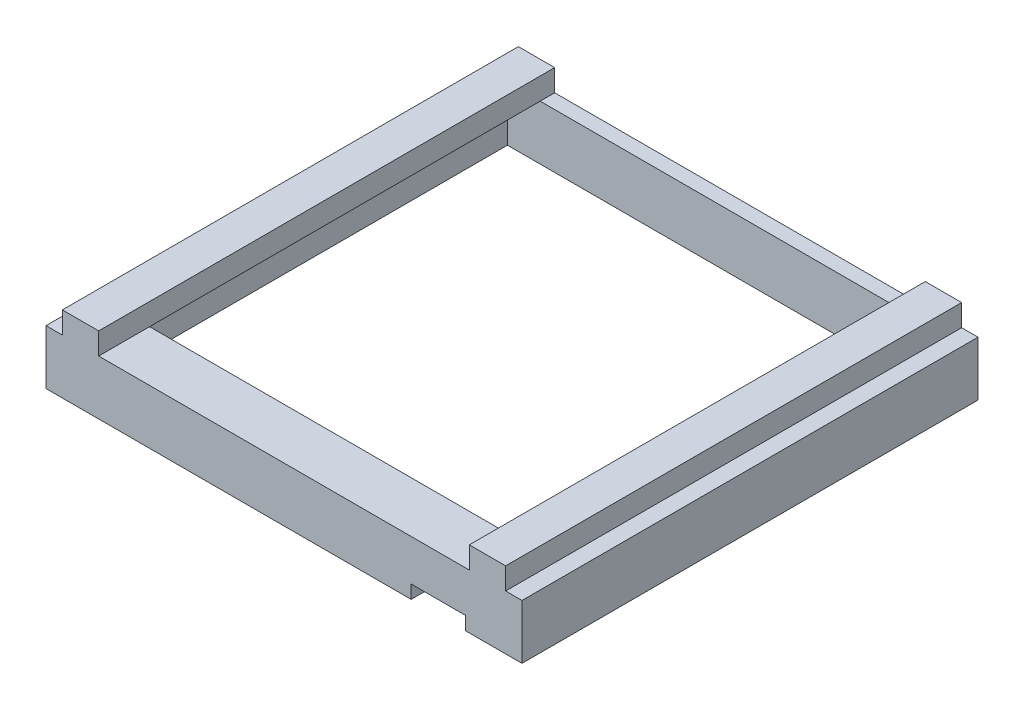
ISO-10303-21;
HEADER;
FILE_DESCRIPTION(('STEP AP214'),'2;1');
FILE_NAME('part.step','',(''),(''),'','','');
FILE_SCHEMA(('AUTOMOTIVE_DESIGN { 1 0 10303 214 1 1 1 1 }'));
ENDSEC;
DATA;
#1=APPLICATION_CONTEXT('core data for automotive mechanical design processes');
#2=APPLICATION_PROTOCOL_DEFINITION('international standard','automotive_design',2000,#1);
#3=PRODUCT_CONTEXT('',#1,'mechanical');
#4=PRODUCT('Part','Part','',(#3));
#5=PRODUCT_RELATED_PRODUCT_CATEGORY('part','',(#4));
#6=PRODUCT_DEFINITION_FORMATION('','',#4);
#7=PRODUCT_DEFINITION_CONTEXT('part definition',#1,'design');
#8=PRODUCT_DEFINITION('design','',#6,#7);
#9=PRODUCT_DEFINITION_SHAPE('','',#8);
#10=(LENGTH_UNIT() NAMED_UNIT(*) SI_UNIT(.MILLI.,.METRE.));
#11=(NAMED_UNIT(*) PLANE_ANGLE_UNIT() SI_UNIT($,.RADIAN.));
#12=(NAMED_UNIT(*) SI_UNIT($,.STERADIAN.) SOLID_ANGLE_UNIT());
#13=UNCERTAINTY_MEASURE_WITH_UNIT(LENGTH_MEASURE(1.E-05),#10,'distance_accuracy_value','');
#14=(GEOMETRIC_REPRESENTATION_CONTEXT(3) GLOBAL_UNCERTAINTY_ASSIGNED_CONTEXT((#13)) GLOBAL_UNIT_ASSIGNED_CONTEXT((#10,
#11,#12)) REPRESENTATION_CONTEXT('',''));
#15=CARTESIAN_POINT('',(0.,0.,0.));
#16=DIRECTION('',(0.,0.,1.));
#17=DIRECTION('',(1.,0.,0.));
#18=AXIS2_PLACEMENT_3D('',#15,#16,#17);
#19=CARTESIAN_POINT('',(0.,15.,0.));
#20=DIRECTION('',(0.,1.,0.));
#21=DIRECTION('',(0.,0.,1.));
#22=AXIS2_PLACEMENT_3D('',#19,#20,#21);
#23=PLANE('',#22);
#24=DIRECTION('',(0.,0.,1.));
#25=VECTOR('',#24,1.);
#26=CARTESIAN_POINT('',(-89.2638888888889,15.,-65.25));
#27=LINE('',#26,#25);
#28=CARTESIAN_POINT('',(-89.2638888888889,15.,-65.25));
#29=VERTEX_POINT('',#28);
#30=CARTESIAN_POINT('',(-89.2638888888889,15.,-61.25));
#31=VERTEX_POINT('',#30);
#32=EDGE_CURVE('E417',#29,#31,#27,.T.);
#33=ORIENTED_EDGE('',*,*,#32,.T.);
#34=DIRECTION('',(-1.,0.,0.));
#35=VECTOR('',#34,1.);
#36=CARTESIAN_POINT('',(13.7361111111111,15.,-61.25));
#37=LINE('',#36,#35);
#38=CARTESIAN_POINT('',(12.7361111111112,15.,-61.25));
#39=VERTEX_POINT('',#38);
#40=EDGE_CURVE('E284',#39,#31,#37,.T.);
#41=ORIENTED_EDGE('',*,*,#40,.F.);
#42=DIRECTION('',(0.,0.,1.));
#43=VECTOR('',#42,1.);
#44=CARTESIAN_POINT('',(12.7361111111111,15.,-65.25));
#45=LINE('',#44,#43);
#46=CARTESIAN_POINT('',(12.7361111111111,15.,-65.25));
#47=VERTEX_POINT('',#46);
#48=EDGE_CURVE('E342',#47,#39,#45,.T.);
#49=ORIENTED_EDGE('',*,*,#48,.F.);
#50=DIRECTION('',(1.,0.,0.));
#51=VECTOR('',#50,1.);
#52=CARTESIAN_POINT('',(0.,15.,-65.25));
#53=LINE('',#52,#51);
#54=EDGE_CURVE('E462',#29,#47,#53,.T.);
#55=ORIENTED_EDGE('',*,*,#54,.F.);
#56=EDGE_LOOP('',(#33,#41,#49,#55));
#57=FACE_BOUND('',#56,.T.);
#58=ADVANCED_FACE('F47',(#57),#23,.T.);
#59=CARTESIAN_POINT('',(0.,15.,54.75));
#60=DIRECTION('',(0.,0.,-1.));
#61=DIRECTION('',(-1.,0.,0.));
#62=AXIS2_PLACEMENT_3D('',#59,#60,#61);
#63=PLANE('',#62);
#64=DIRECTION('',(-1.,0.,0.));
#65=VECTOR('',#64,1.);
#66=CARTESIAN_POINT('',(13.7361111111111,12.,54.75));
#67=LINE('',#66,#65);
#68=CARTESIAN_POINT('',(13.7361111111111,12.,54.75));
#69=VERTEX_POINT('',#68);
#70=CARTESIAN_POINT('',(-90.2638888888889,12.,54.75));
#71=VERTEX_POINT('',#70);
#72=EDGE_CURVE('E289',#69,#71,#67,.T.);
#73=ORIENTED_EDGE('',*,*,#72,.F.);
#74=DIRECTION('',(0.,1.,0.));
#75=VECTOR('',#74,1.);
#76=CARTESIAN_POINT('',(13.7361111111111,0.,54.75));
#77=LINE('',#76,#75);
#78=CARTESIAN_POINT('',(13.7361111111111,20.,54.75));
#79=VERTEX_POINT('',#78);
#80=EDGE_CURVE('E316',#69,#79,#77,.T.);
#81=ORIENTED_EDGE('',*,*,#80,.T.);
#82=DIRECTION('',(-1.,0.,0.));
#83=VECTOR('',#82,1.);
#84=CARTESIAN_POINT('',(0.,20.,54.75));
#85=LINE('',#84,#83);
#86=CARTESIAN_POINT('',(21.7361111111111,20.,54.75));
#87=VERTEX_POINT('',#86);
#88=EDGE_CURVE('E322',#87,#79,#85,.T.);
#89=ORIENTED_EDGE('',*,*,#88,.F.);
#90=DIRECTION('',(0.,-1.,0.));
#91=VECTOR('',#90,1.);
#92=CARTESIAN_POINT('',(21.7361111111111,15.,54.75));
#93=LINE('',#92,#91);
#94=CARTESIAN_POINT('',(21.7361111111111,0.,54.75));
#95=VERTEX_POINT('',#94);
#96=EDGE_CURVE('E516',#87,#95,#93,.T.);
#97=ORIENTED_EDGE('',*,*,#96,.T.);
#98=DIRECTION('',(1.,0.,0.));
#99=VECTOR('',#98,1.);
#100=CARTESIAN_POINT('',(0.,0.,54.75));
#101=LINE('',#100,#99);
#102=CARTESIAN_POINT('',(11.7361111111111,0.,54.75));
#103=VERTEX_POINT('',#102);
#104=EDGE_CURVE('E470',#103,#95,#101,.T.);
#105=ORIENTED_EDGE('',*,*,#104,.F.);
#106=DIRECTION('',(0.,-1.,0.));
#107=VECTOR('',#106,1.);
#108=CARTESIAN_POINT('',(11.7361111111111,15.,54.75));
#109=LINE('',#108,#107);
#110=CARTESIAN_POINT('',(11.7361111111111,3.66537418108237,54.75));
#111=VERTEX_POINT('',#110);
#112=EDGE_CURVE('E513',#111,#103,#109,.T.);
#113=ORIENTED_EDGE('',*,*,#112,.F.);
#114=DIRECTION('',(-1.,0.,0.));
#115=VECTOR('',#114,1.);
#116=CARTESIAN_POINT('',(11.7361111111111,3.66537418108237,54.75));
#117=LINE('',#116,#115);
#118=CARTESIAN_POINT('',(-3.26388888888887,3.66537418108237,54.75));
#119=VERTEX_POINT('',#118);
#120=EDGE_CURVE('E383',#111,#119,#117,.T.);
#121=ORIENTED_EDGE('',*,*,#120,.T.);
#122=DIRECTION('',(0.,-1.,0.));
#123=VECTOR('',#122,1.);
#124=CARTESIAN_POINT('',(-3.26388888888887,15.,54.75));
#125=LINE('',#124,#123);
#126=CARTESIAN_POINT('',(-3.26388888888887,0.,54.75));
#127=VERTEX_POINT('',#126);
#128=EDGE_CURVE('E56',#119,#127,#125,.T.);
#129=ORIENTED_EDGE('',*,*,#128,.T.);
#130=CARTESIAN_POINT('',(-98.2638888888889,0.,54.75));
#131=VERTEX_POINT('',#130);
#132=EDGE_CURVE('E248',#131,#127,#101,.T.);
#133=ORIENTED_EDGE('',*,*,#132,.F.);
#134=DIRECTION('',(0.,-1.,0.));
#135=VECTOR('',#134,1.);
#136=CARTESIAN_POINT('',(-98.2638888888889,15.,54.75));
#137=LINE('',#136,#135);
#138=CARTESIAN_POINT('',(-98.2638888888889,20.,54.75));
#139=VERTEX_POINT('',#138);
#140=EDGE_CURVE('E241',#139,#131,#137,.T.);
#141=ORIENTED_EDGE('',*,*,#140,.F.);
#142=DIRECTION('',(-1.,0.,0.));
#143=VECTOR('',#142,1.);
#144=CARTESIAN_POINT('',(0.,20.,54.75));
#145=LINE('',#144,#143);
#146=CARTESIAN_POINT('',(-90.2638888888889,20.,54.75));
#147=VERTEX_POINT('',#146);
#148=EDGE_CURVE('E393',#147,#139,#145,.T.);
#149=ORIENTED_EDGE('',*,*,#148,.F.);
#150=DIRECTION('',(0.,-1.,0.));
#151=VECTOR('',#150,1.);
#152=CARTESIAN_POINT('',(-90.2638888888889,0.,54.75));
#153=LINE('',#152,#151);
#154=EDGE_CURVE('E387',#147,#71,#153,.T.);
#155=ORIENTED_EDGE('',*,*,#154,.T.);
#156=EDGE_LOOP('',(#73,#81,#89,#97,#105,#113,#121,#129,#133,#141,#149,#155));
#157=FACE_BOUND('',#156,.T.);
#158=ADVANCED_FACE('F524',(#157),#63,.T.);
#159=CARTESIAN_POINT('',(21.7361111111111,15.,0.));
#160=DIRECTION('',(-1.,0.,0.));
#161=DIRECTION('',(0.,0.,1.));
#162=AXIS2_PLACEMENT_3D('',#159,#160,#161);
#163=PLANE('',#162);
#164=DIRECTION('',(0.,0.,1.));
#165=VECTOR('',#164,1.);
#166=CARTESIAN_POINT('',(21.7361111111111,20.,-65.25));
#167=LINE('',#166,#165);
#168=CARTESIAN_POINT('',(21.7361111111111,20.,-61.25));
#169=VERTEX_POINT('',#168);
#170=EDGE_CURVE('E338',#169,#87,#167,.T.);
#171=ORIENTED_EDGE('',*,*,#170,.F.);
#172=DIRECTION('',(0.,1.,0.));
#173=VECTOR('',#172,1.);
#174=CARTESIAN_POINT('',(21.7361111111111,0.,-61.25));
#175=LINE('',#174,#173);
#176=CARTESIAN_POINT('',(21.7361111111111,0.,-61.25));
#177=VERTEX_POINT('',#176);
#178=EDGE_CURVE('E265',#177,#169,#175,.T.);
#179=ORIENTED_EDGE('',*,*,#178,.F.);
#180=DIRECTION('',(0.,0.,-1.));
#181=VECTOR('',#180,1.);
#182=CARTESIAN_POINT('',(21.7361111111111,0.,0.));
#183=LINE('',#182,#181);
#184=EDGE_CURVE('E247',#95,#177,#183,.T.);
#185=ORIENTED_EDGE('',*,*,#184,.F.);
#186=ORIENTED_EDGE('',*,*,#96,.F.);
#187=EDGE_LOOP('',(#171,#179,#185,#186));
#188=FACE_BOUND('',#187,.T.);
#189=ADVANCED_FACE('F642',(#188),#163,.T.);
#190=CARTESIAN_POINT('',(13.7361111111111,0.,-65.25));
#191=DIRECTION('',(1.,0.,0.));
#192=DIRECTION('',(0.,0.,-1.));
#193=AXIS2_PLACEMENT_3D('',#190,#191,#192);
#194=PLANE('',#193);
#195=DIRECTION('',(0.,0.,1.));
#196=VECTOR('',#195,1.);
#197=CARTESIAN_POINT('',(13.7361111111111,15.,-65.25));
#198=LINE('',#197,#196);
#199=CARTESIAN_POINT('',(13.7361111111111,15.,-61.25));
#200=VERTEX_POINT('',#199);
#201=CARTESIAN_POINT('',(13.7361111111111,15.,46.25));
#202=VERTEX_POINT('',#201);
#203=EDGE_CURVE('E346',#200,#202,#198,.T.);
#204=ORIENTED_EDGE('',*,*,#203,.F.);
#205=DIRECTION('',(0.,-1.,0.));
#206=VECTOR('',#205,1.);
#207=CARTESIAN_POINT('',(13.7361111111111,20.,-61.25));
#208=LINE('',#207,#206);
#209=CARTESIAN_POINT('',(13.7361111111111,20.,-61.25));
#210=VERTEX_POINT('',#209);
#211=EDGE_CURVE('E274',#210,#200,#208,.T.);
#212=ORIENTED_EDGE('',*,*,#211,.F.);
#213=DIRECTION('',(0.,0.,1.));
#214=VECTOR('',#213,1.);
#215=CARTESIAN_POINT('',(13.7361111111111,20.,-65.25));
#216=LINE('',#215,#214);
#217=EDGE_CURVE('E329',#210,#79,#216,.T.);
#218=ORIENTED_EDGE('',*,*,#217,.T.);
#219=ORIENTED_EDGE('',*,*,#80,.F.);
#220=DIRECTION('',(0.,0.,1.));
#221=VECTOR('',#220,1.);
#222=CARTESIAN_POINT('',(13.7361111111111,12.,46.25));
#223=LINE('',#222,#221);
#224=CARTESIAN_POINT('',(13.7361111111111,12.,46.25));
#225=VERTEX_POINT('',#224);
#226=EDGE_CURVE('E312',#225,#69,#223,.T.);
#227=ORIENTED_EDGE('',*,*,#226,.F.);
#228=DIRECTION('',(0.,-1.,0.));
#229=VECTOR('',#228,1.);
#230=CARTESIAN_POINT('',(13.7361111111111,15.,46.25));
#231=LINE('',#230,#229);
#232=EDGE_CURVE('E290',#202,#225,#231,.T.);
#233=ORIENTED_EDGE('',*,*,#232,.F.);
#234=EDGE_LOOP('',(#204,#212,#218,#219,#227,#233));
#235=FACE_BOUND('',#234,.T.);
#236=ADVANCED_FACE('F754',(#235),#194,.T.);
#237=CARTESIAN_POINT('',(0.,20.,-65.25));
#238=DIRECTION('',(0.,1.,0.));
#239=DIRECTION('',(0.,0.,1.));
#240=AXIS2_PLACEMENT_3D('',#237,#238,#239);
#241=PLANE('',#240);
#242=ORIENTED_EDGE('',*,*,#217,.F.);
#243=DIRECTION('',(-1.,0.,0.));
#244=VECTOR('',#243,1.);
#245=CARTESIAN_POINT('',(21.7361111111111,20.,-61.25));
#246=LINE('',#245,#244);
#247=EDGE_CURVE('E268',#169,#210,#246,.T.);
#248=ORIENTED_EDGE('',*,*,#247,.F.);
#249=ORIENTED_EDGE('',*,*,#170,.T.);
#250=ORIENTED_EDGE('',*,*,#88,.T.);
#251=EDGE_LOOP('',(#242,#248,#249,#250));
#252=FACE_BOUND('',#251,.T.);
#253=ADVANCED_FACE('F647',(#252),#241,.F.);
#254=CARTESIAN_POINT('',(22.7361111111111,15.,-65.25));
#255=VERTEX_POINT('',#254);
#256=CARTESIAN_POINT('',(27.2361111111111,15.,-65.25));
#257=VERTEX_POINT('',#256);
#258=EDGE_CURVE('E456',#255,#257,#53,.T.);
#259=ORIENTED_EDGE('',*,*,#258,.F.);
#260=DIRECTION('',(0.,0.,-1.));
#261=VECTOR('',#260,1.);
#262=CARTESIAN_POINT('',(22.7361111111111,15.,60.25));
#263=LINE('',#262,#261);
#264=CARTESIAN_POINT('',(22.7361111111111,15.,60.25));
#265=VERTEX_POINT('',#264);
#266=EDGE_CURVE('E354',#265,#255,#263,.T.);
#267=ORIENTED_EDGE('',*,*,#266,.F.);
#268=DIRECTION('',(1.,0.,0.));
#269=VECTOR('',#268,1.);
#270=CARTESIAN_POINT('',(0.,15.,60.25));
#271=LINE('',#270,#269);
#272=CARTESIAN_POINT('',(27.2361111111111,15.,60.25));
#273=VERTEX_POINT('',#272);
#274=EDGE_CURVE('E451',#265,#273,#271,.T.);
#275=ORIENTED_EDGE('',*,*,#274,.T.);
#276=DIRECTION('',(0.,0.,-1.));
#277=VECTOR('',#276,1.);
#278=CARTESIAN_POINT('',(27.2361111111111,15.,0.));
#279=LINE('',#278,#277);
#280=EDGE_CURVE('E450',#273,#257,#279,.T.);
#281=ORIENTED_EDGE('',*,*,#280,.T.);
#282=EDGE_LOOP('',(#259,#267,#275,#281));
#283=FACE_BOUND('',#282,.T.);
#284=ADVANCED_FACE('F608',(#283),#23,.T.);
#285=CARTESIAN_POINT('',(-3.26388888888888,15.,0.));
#286=DIRECTION('',(1.,0.,0.));
#287=DIRECTION('',(0.,0.,-1.));
#288=AXIS2_PLACEMENT_3D('',#285,#286,#287);
#289=PLANE('',#288);
#290=ORIENTED_EDGE('',*,*,#128,.F.);
#291=DIRECTION('',(0.,0.,-1.));
#292=VECTOR('',#291,1.);
#293=CARTESIAN_POINT('',(-3.26388888888887,3.66537418108237,60.25));
#294=LINE('',#293,#292);
#295=CARTESIAN_POINT('',(-3.26388888888887,3.66537418108237,60.25));
#296=VERTEX_POINT('',#295);
#297=EDGE_CURVE('E371',#296,#119,#294,.T.);
#298=ORIENTED_EDGE('',*,*,#297,.F.);
#299=DIRECTION('',(0.,-1.,0.));
#300=VECTOR('',#299,1.);
#301=CARTESIAN_POINT('',(-3.26388888888887,15.,60.25));
#302=LINE('',#301,#300);
#303=CARTESIAN_POINT('',(-3.26388888888887,0.,60.25));
#304=VERTEX_POINT('',#303);
#305=EDGE_CURVE('E494',#296,#304,#302,.T.);
#306=ORIENTED_EDGE('',*,*,#305,.T.);
#307=DIRECTION('',(0.,0.,1.));
#308=VECTOR('',#307,1.);
#309=CARTESIAN_POINT('',(-3.26388888888888,0.,0.));
#310=LINE('',#309,#308);
#311=EDGE_CURVE('E446',#127,#304,#310,.T.);
#312=ORIENTED_EDGE('',*,*,#311,.F.);
#313=EDGE_LOOP('',(#290,#298,#306,#312));
#314=FACE_BOUND('',#313,.T.);
#315=ADVANCED_FACE('F49',(#314),#289,.T.);
#316=CARTESIAN_POINT('',(11.7361111111111,15.,0.));
#317=DIRECTION('',(-1.,0.,0.));
#318=DIRECTION('',(0.,0.,1.));
#319=AXIS2_PLACEMENT_3D('',#316,#317,#318);
#320=PLANE('',#319);
#321=DIRECTION('',(0.,-1.,0.));
#322=VECTOR('',#321,1.);
#323=CARTESIAN_POINT('',(11.7361111111111,15.,60.25));
#324=LINE('',#323,#322);
#325=CARTESIAN_POINT('',(11.7361111111111,3.66537418108237,60.25));
#326=VERTEX_POINT('',#325);
#327=CARTESIAN_POINT('',(11.7361111111111,0.,60.25));
#328=VERTEX_POINT('',#327);
#329=EDGE_CURVE('E510',#326,#328,#324,.T.);
#330=ORIENTED_EDGE('',*,*,#329,.F.);
#331=DIRECTION('',(0.,0.,-1.));
#332=VECTOR('',#331,1.);
#333=CARTESIAN_POINT('',(11.7361111111111,3.66537418108237,60.25));
#334=LINE('',#333,#332);
#335=EDGE_CURVE('E372',#326,#111,#334,.T.);
#336=ORIENTED_EDGE('',*,*,#335,.T.);
#337=ORIENTED_EDGE('',*,*,#112,.T.);
#338=DIRECTION('',(0.,0.,-1.));
#339=VECTOR('',#338,1.);
#340=CARTESIAN_POINT('',(11.7361111111111,0.,0.));
#341=LINE('',#340,#339);
#342=EDGE_CURVE('E474',#328,#103,#341,.T.);
#343=ORIENTED_EDGE('',*,*,#342,.F.);
#344=EDGE_LOOP('',(#330,#336,#337,#343));
#345=FACE_BOUND('',#344,.T.);
#346=ADVANCED_FACE('F554',(#345),#320,.T.);
#347=CARTESIAN_POINT('',(-98.2638888888889,15.,0.));
#348=DIRECTION('',(-1.,0.,0.));
#349=DIRECTION('',(0.,0.,1.));
#350=AXIS2_PLACEMENT_3D('',#347,#348,#349);
#351=PLANE('',#350);
#352=DIRECTION('',(0.,0.,-1.));
#353=VECTOR('',#352,1.);
#354=CARTESIAN_POINT('',(-98.2638888888889,0.,0.));
#355=LINE('',#354,#353);
#356=CARTESIAN_POINT('',(-98.2638888888889,0.,-61.25));
#357=VERTEX_POINT('',#356);
#358=EDGE_CURVE('E235',#131,#357,#355,.T.);
#359=ORIENTED_EDGE('',*,*,#358,.T.);
#360=DIRECTION('',(0.,-1.,0.));
#361=VECTOR('',#360,1.);
#362=CARTESIAN_POINT('',(-98.2638888888889,20.,-61.25));
#363=LINE('',#362,#361);
#364=CARTESIAN_POINT('',(-98.2638888888889,20.,-61.25));
#365=VERTEX_POINT('',#364);
#366=EDGE_CURVE('E238',#365,#357,#363,.T.);
#367=ORIENTED_EDGE('',*,*,#366,.F.);
#368=DIRECTION('',(0.,0.,1.));
#369=VECTOR('',#368,1.);
#370=CARTESIAN_POINT('',(-98.2638888888889,20.,-65.25));
#371=LINE('',#370,#369);
#372=EDGE_CURVE('E401',#365,#139,#371,.T.);
#373=ORIENTED_EDGE('',*,*,#372,.T.);
#374=ORIENTED_EDGE('',*,*,#140,.T.);
#375=EDGE_LOOP('',(#359,#367,#373,#374));
#376=FACE_BOUND('',#375,.T.);
#377=ADVANCED_FACE('F237',(#376),#351,.F.);
#378=CARTESIAN_POINT('',(-90.2638888888889,0.,-65.25));
#379=DIRECTION('',(-1.,0.,0.));
#380=DIRECTION('',(0.,0.,1.));
#381=AXIS2_PLACEMENT_3D('',#378,#379,#380);
#382=PLANE('',#381);
#383=DIRECTION('',(0.,0.,1.));
#384=VECTOR('',#383,1.);
#385=CARTESIAN_POINT('',(-90.2638888888889,20.,-65.25));
#386=LINE('',#385,#384);
#387=CARTESIAN_POINT('',(-90.2638888888889,20.,-61.25));
#388=VERTEX_POINT('',#387);
#389=EDGE_CURVE('E409',#388,#147,#386,.T.);
#390=ORIENTED_EDGE('',*,*,#389,.F.);
#391=DIRECTION('',(0.,1.,0.));
#392=VECTOR('',#391,1.);
#393=CARTESIAN_POINT('',(-90.2638888888889,15.,-61.25));
#394=LINE('',#393,#392);
#395=CARTESIAN_POINT('',(-90.2638888888889,15.,-61.25));
#396=VERTEX_POINT('',#395);
#397=EDGE_CURVE('E283',#396,#388,#394,.T.);
#398=ORIENTED_EDGE('',*,*,#397,.F.);
#399=DIRECTION('',(0.,0.,1.));
#400=VECTOR('',#399,1.);
#401=CARTESIAN_POINT('',(-90.2638888888889,15.,-65.25));
#402=LINE('',#401,#400);
#403=CARTESIAN_POINT('',(-90.2638888888889,15.,46.25));
#404=VERTEX_POINT('',#403);
#405=EDGE_CURVE('E412',#396,#404,#402,.T.);
#406=ORIENTED_EDGE('',*,*,#405,.T.);
#407=DIRECTION('',(0.,1.,0.));
#408=VECTOR('',#407,1.);
#409=CARTESIAN_POINT('',(-90.2638888888889,15.,46.25));
#410=LINE('',#409,#408);
#411=CARTESIAN_POINT('',(-90.2638888888889,12.,46.25));
#412=VERTEX_POINT('',#411);
#413=EDGE_CURVE('E297',#412,#404,#410,.T.);
#414=ORIENTED_EDGE('',*,*,#413,.F.);
#415=DIRECTION('',(0.,0.,1.));
#416=VECTOR('',#415,1.);
#417=CARTESIAN_POINT('',(-90.2638888888889,12.,46.25));
#418=LINE('',#417,#416);
#419=EDGE_CURVE('E305',#412,#71,#418,.T.);
#420=ORIENTED_EDGE('',*,*,#419,.T.);
#421=ORIENTED_EDGE('',*,*,#154,.F.);
#422=EDGE_LOOP('',(#390,#398,#406,#414,#420,#421));
#423=FACE_BOUND('',#422,.T.);
#424=ADVANCED_FACE('F571',(#423),#382,.T.);
#425=CARTESIAN_POINT('',(0.,20.,-65.25));
#426=DIRECTION('',(0.,1.,0.));
#427=DIRECTION('',(0.,0.,1.));
#428=AXIS2_PLACEMENT_3D('',#425,#426,#427);
#429=PLANE('',#428);
#430=ORIENTED_EDGE('',*,*,#372,.F.);
#431=DIRECTION('',(-1.,0.,0.));
#432=VECTOR('',#431,1.);
#433=CARTESIAN_POINT('',(-90.2638888888889,20.,-61.25));
#434=LINE('',#433,#432);
#435=EDGE_CURVE('E257',#388,#365,#434,.T.);
#436=ORIENTED_EDGE('',*,*,#435,.F.);
#437=ORIENTED_EDGE('',*,*,#389,.T.);
#438=ORIENTED_EDGE('',*,*,#148,.T.);
#439=EDGE_LOOP('',(#430,#436,#437,#438));
#440=FACE_BOUND('',#439,.T.);
#441=ADVANCED_FACE('F576',(#440),#429,.F.);
#442=DIRECTION('',(0.,0.,1.));
#443=VECTOR('',#442,1.);
#444=CARTESIAN_POINT('',(-99.2638888888889,15.,60.25));
#445=LINE('',#444,#443);
#446=CARTESIAN_POINT('',(-99.2638888888889,15.,-65.25));
#447=VERTEX_POINT('',#446);
#448=CARTESIAN_POINT('',(-99.2638888888889,15.,60.25));
#449=VERTEX_POINT('',#448);
#450=EDGE_CURVE('E421',#447,#449,#445,.T.);
#451=ORIENTED_EDGE('',*,*,#450,.F.);
#452=CARTESIAN_POINT('',(-103.763888888889,15.,-65.25));
#453=VERTEX_POINT('',#452);
#454=EDGE_CURVE('E457',#453,#447,#53,.T.);
#455=ORIENTED_EDGE('',*,*,#454,.F.);
#456=DIRECTION('',(0.,0.,-1.));
#457=VECTOR('',#456,1.);
#458=CARTESIAN_POINT('',(-103.763888888889,15.,0.));
#459=LINE('',#458,#457);
#460=CARTESIAN_POINT('',(-103.763888888889,15.,60.25));
#461=VERTEX_POINT('',#460);
#462=EDGE_CURVE('E461',#461,#453,#459,.T.);
#463=ORIENTED_EDGE('',*,*,#462,.F.);
#464=EDGE_CURVE('E452',#461,#449,#271,.T.);
#465=ORIENTED_EDGE('',*,*,#464,.T.);
#466=EDGE_LOOP('',(#451,#455,#463,#465));
#467=FACE_BOUND('',#466,.T.);
#468=ADVANCED_FACE('F612',(#467),#23,.T.);
#469=CARTESIAN_POINT('',(27.2361111111111,15.,0.));
#470=DIRECTION('',(-1.,0.,0.));
#471=DIRECTION('',(0.,0.,1.));
#472=AXIS2_PLACEMENT_3D('',#469,#470,#471);
#473=PLANE('',#472);
#474=DIRECTION('',(0.,0.,-1.));
#475=VECTOR('',#474,1.);
#476=CARTESIAN_POINT('',(27.2361111111111,0.,0.));
#477=LINE('',#476,#475);
#478=CARTESIAN_POINT('',(27.2361111111111,0.,60.25));
#479=VERTEX_POINT('',#478);
#480=CARTESIAN_POINT('',(27.2361111111111,0.,-65.25));
#481=VERTEX_POINT('',#480);
#482=EDGE_CURVE('E481',#479,#481,#477,.T.);
#483=ORIENTED_EDGE('',*,*,#482,.T.);
#484=DIRECTION('',(0.,-1.,0.));
#485=VECTOR('',#484,1.);
#486=CARTESIAN_POINT('',(27.2361111111111,15.,-65.25));
#487=LINE('',#486,#485);
#488=EDGE_CURVE('E503',#257,#481,#487,.T.);
#489=ORIENTED_EDGE('',*,*,#488,.F.);
#490=ORIENTED_EDGE('',*,*,#280,.F.);
#491=DIRECTION('',(0.,-1.,0.));
#492=VECTOR('',#491,1.);
#493=CARTESIAN_POINT('',(27.2361111111111,15.,60.25));
#494=LINE('',#493,#492);
#495=EDGE_CURVE('E506',#273,#479,#494,.T.);
#496=ORIENTED_EDGE('',*,*,#495,.T.);
#497=EDGE_LOOP('',(#483,#489,#490,#496));
#498=FACE_BOUND('',#497,.T.);
#499=ADVANCED_FACE('F546',(#498),#473,.F.);
#500=CARTESIAN_POINT('',(0.,15.,-65.25));
#501=DIRECTION('',(0.,0.,-1.));
#502=DIRECTION('',(-1.,0.,0.));
#503=AXIS2_PLACEMENT_3D('',#500,#501,#502);
#504=PLANE('',#503);
#505=DIRECTION('',(0.,-1.,0.));
#506=VECTOR('',#505,1.);
#507=CARTESIAN_POINT('',(22.7361111111111,0.,-65.25));
#508=LINE('',#507,#506);
#509=CARTESIAN_POINT('',(22.7361111111111,21.,-65.25));
#510=VERTEX_POINT('',#509);
#511=EDGE_CURVE('E325',#510,#255,#508,.T.);
#512=ORIENTED_EDGE('',*,*,#511,.T.);
#513=ORIENTED_EDGE('',*,*,#258,.T.);
#514=ORIENTED_EDGE('',*,*,#488,.T.);
#515=DIRECTION('',(1.,0.,0.));
#516=VECTOR('',#515,1.);
#517=CARTESIAN_POINT('',(0.,0.,-65.25));
#518=LINE('',#517,#516);
#519=CARTESIAN_POINT('',(-103.763888888889,0.,-65.25));
#520=VERTEX_POINT('',#519);
#521=EDGE_CURVE('E486',#520,#481,#518,.T.);
#522=ORIENTED_EDGE('',*,*,#521,.F.);
#523=DIRECTION('',(0.,-1.,0.));
#524=VECTOR('',#523,1.);
#525=CARTESIAN_POINT('',(-103.763888888889,15.,-65.25));
#526=LINE('',#525,#524);
#527=EDGE_CURVE('E500',#453,#520,#526,.T.);
#528=ORIENTED_EDGE('',*,*,#527,.F.);
#529=ORIENTED_EDGE('',*,*,#454,.T.);
#530=DIRECTION('',(0.,1.,0.));
#531=VECTOR('',#530,1.);
#532=CARTESIAN_POINT('',(-99.2638888888889,0.,-65.25));
#533=LINE('',#532,#531);
#534=CARTESIAN_POINT('',(-99.2638888888889,21.,-65.25));
#535=VERTEX_POINT('',#534);
#536=EDGE_CURVE('E388',#447,#535,#533,.T.);
#537=ORIENTED_EDGE('',*,*,#536,.T.);
#538=DIRECTION('',(1.,0.,0.));
#539=VECTOR('',#538,1.);
#540=CARTESIAN_POINT('',(0.,21.,-65.25));
#541=LINE('',#540,#539);
#542=CARTESIAN_POINT('',(-89.2638888888889,21.,-65.25));
#543=VERTEX_POINT('',#542);
#544=EDGE_CURVE('E392',#535,#543,#541,.T.);
#545=ORIENTED_EDGE('',*,*,#544,.T.);
#546=DIRECTION('',(0.,-1.,0.));
#547=VECTOR('',#546,1.);
#548=CARTESIAN_POINT('',(-89.2638888888889,0.,-65.25));
#549=LINE('',#548,#547);
#550=EDGE_CURVE('E397',#543,#29,#549,.T.);
#551=ORIENTED_EDGE('',*,*,#550,.T.);
#552=ORIENTED_EDGE('',*,*,#54,.T.);
#553=DIRECTION('',(0.,1.,0.));
#554=VECTOR('',#553,1.);
#555=CARTESIAN_POINT('',(12.7361111111111,0.,-65.25));
#556=LINE('',#555,#554);
#557=CARTESIAN_POINT('',(12.7361111111111,21.,-65.25));
#558=VERTEX_POINT('',#557);
#559=EDGE_CURVE('E317',#47,#558,#556,.T.);
#560=ORIENTED_EDGE('',*,*,#559,.T.);
#561=DIRECTION('',(1.,0.,0.));
#562=VECTOR('',#561,1.);
#563=CARTESIAN_POINT('',(0.,21.,-65.25));
#564=LINE('',#563,#562);
#565=EDGE_CURVE('E321',#558,#510,#564,.T.);
#566=ORIENTED_EDGE('',*,*,#565,.T.);
#567=EDGE_LOOP('',(#512,#513,#514,#522,#528,#529,#537,#545,#551,#552,#560,#566));
#568=FACE_BOUND('',#567,.T.);
#569=ADVANCED_FACE('F540',(#568),#504,.T.);
#570=CARTESIAN_POINT('',(-103.763888888889,15.,0.));
#571=DIRECTION('',(-1.,0.,0.));
#572=DIRECTION('',(0.,0.,1.));
#573=AXIS2_PLACEMENT_3D('',#570,#571,#572);
#574=PLANE('',#573);
#575=DIRECTION('',(0.,0.,-1.));
#576=VECTOR('',#575,1.);
#577=CARTESIAN_POINT('',(-103.763888888889,0.,0.));
#578=LINE('',#577,#576);
#579=CARTESIAN_POINT('',(-103.763888888889,0.,60.25));
#580=VERTEX_POINT('',#579);
#581=EDGE_CURVE('E490',#580,#520,#578,.T.);
#582=ORIENTED_EDGE('',*,*,#581,.F.);
#583=DIRECTION('',(0.,-1.,0.));
#584=VECTOR('',#583,1.);
#585=CARTESIAN_POINT('',(-103.763888888889,15.,60.25));
#586=LINE('',#585,#584);
#587=EDGE_CURVE('E497',#461,#580,#586,.T.);
#588=ORIENTED_EDGE('',*,*,#587,.F.);
#589=ORIENTED_EDGE('',*,*,#462,.T.);
#590=ORIENTED_EDGE('',*,*,#527,.T.);
#591=EDGE_LOOP('',(#582,#588,#589,#590));
#592=FACE_BOUND('',#591,.T.);
#593=ADVANCED_FACE('F534',(#592),#574,.T.);
#594=CARTESIAN_POINT('',(0.,15.,60.25));
#595=DIRECTION('',(0.,0.,-1.));
#596=DIRECTION('',(-1.,0.,0.));
#597=AXIS2_PLACEMENT_3D('',#594,#595,#596);
#598=PLANE('',#597);
#599=DIRECTION('',(1.,0.,0.));
#600=VECTOR('',#599,1.);
#601=CARTESIAN_POINT('',(0.,0.,60.25));
#602=LINE('',#601,#600);
#603=EDGE_CURVE('E482',#580,#304,#602,.T.);
#604=ORIENTED_EDGE('',*,*,#603,.T.);
#605=ORIENTED_EDGE('',*,*,#305,.F.);
#606=DIRECTION('',(-1.,0.,0.));
#607=VECTOR('',#606,1.);
#608=CARTESIAN_POINT('',(11.7361111111111,3.66537418108237,60.25));
#609=LINE('',#608,#607);
#610=EDGE_CURVE('E376',#326,#296,#609,.T.);
#611=ORIENTED_EDGE('',*,*,#610,.F.);
#612=ORIENTED_EDGE('',*,*,#329,.T.);
#613=EDGE_CURVE('E478',#328,#479,#602,.T.);
#614=ORIENTED_EDGE('',*,*,#613,.T.);
#615=ORIENTED_EDGE('',*,*,#495,.F.);
#616=ORIENTED_EDGE('',*,*,#274,.F.);
#617=DIRECTION('',(0.,-1.,0.));
#618=VECTOR('',#617,1.);
#619=CARTESIAN_POINT('',(22.7361111111111,21.,60.25));
#620=LINE('',#619,#618);
#621=CARTESIAN_POINT('',(22.7361111111111,21.,60.25));
#622=VERTEX_POINT('',#621);
#623=EDGE_CURVE('E71',#622,#265,#620,.T.);
#624=ORIENTED_EDGE('',*,*,#623,.F.);
#625=DIRECTION('',(-1.,0.,0.));
#626=VECTOR('',#625,1.);
#627=CARTESIAN_POINT('',(22.7361111111111,21.,60.25));
#628=LINE('',#627,#626);
#629=CARTESIAN_POINT('',(12.7361111111111,21.,60.25));
#630=VERTEX_POINT('',#629);
#631=EDGE_CURVE('E353',#622,#630,#628,.T.);
#632=ORIENTED_EDGE('',*,*,#631,.T.);
#633=DIRECTION('',(0.,-1.,0.));
#634=VECTOR('',#633,1.);
#635=CARTESIAN_POINT('',(12.7361111111111,21.,60.25));
#636=LINE('',#635,#634);
#637=CARTESIAN_POINT('',(12.7361111111111,15.,60.25));
#638=VERTEX_POINT('',#637);
#639=EDGE_CURVE('E368',#630,#638,#636,.T.);
#640=ORIENTED_EDGE('',*,*,#639,.T.);
#641=CARTESIAN_POINT('',(-89.2638888888889,15.,60.25));
#642=VERTEX_POINT('',#641);
#643=EDGE_CURVE('E447',#642,#638,#271,.T.);
#644=ORIENTED_EDGE('',*,*,#643,.F.);
#645=DIRECTION('',(0.,-1.,0.));
#646=VECTOR('',#645,1.);
#647=CARTESIAN_POINT('',(-89.2638888888889,21.,60.25));
#648=LINE('',#647,#646);
#649=CARTESIAN_POINT('',(-89.2638888888889,21.,60.25));
#650=VERTEX_POINT('',#649);
#651=EDGE_CURVE('E433',#650,#642,#648,.T.);
#652=ORIENTED_EDGE('',*,*,#651,.F.);
#653=DIRECTION('',(1.,0.,0.));
#654=VECTOR('',#653,1.);
#655=CARTESIAN_POINT('',(-99.2638888888889,21.,60.25));
#656=LINE('',#655,#654);
#657=CARTESIAN_POINT('',(-99.2638888888889,21.,60.25));
#658=VERTEX_POINT('',#657);
#659=EDGE_CURVE('E426',#658,#650,#656,.T.);
#660=ORIENTED_EDGE('',*,*,#659,.F.);
#661=DIRECTION('',(0.,-1.,0.));
#662=VECTOR('',#661,1.);
#663=CARTESIAN_POINT('',(-99.2638888888889,21.,60.25));
#664=LINE('',#663,#662);
#665=EDGE_CURVE('E442',#658,#449,#664,.T.);
#666=ORIENTED_EDGE('',*,*,#665,.T.);
#667=ORIENTED_EDGE('',*,*,#464,.F.);
#668=ORIENTED_EDGE('',*,*,#587,.T.);
#669=EDGE_LOOP('',(#604,#605,#611,#612,#614,#615,#616,#624,#632,#640,#644,#652,#660,#666,#667,#668));
#670=FACE_BOUND('',#669,.T.);
#671=ADVANCED_FACE('F550',(#670),#598,.F.);
#672=DIRECTION('',(0.,0.,-1.));
#673=VECTOR('',#672,1.);
#674=CARTESIAN_POINT('',(12.7361111111111,15.,60.25));
#675=LINE('',#674,#673);
#676=CARTESIAN_POINT('',(12.7361111111111,15.,46.25));
#677=VERTEX_POINT('',#676);
#678=EDGE_CURVE('E63',#638,#677,#675,.T.);
#679=ORIENTED_EDGE('',*,*,#678,.T.);
#680=DIRECTION('',(1.,0.,0.));
#681=VECTOR('',#680,1.);
#682=CARTESIAN_POINT('',(13.7361111111111,15.,46.25));
#683=LINE('',#682,#681);
#684=CARTESIAN_POINT('',(-89.2638888888889,15.,46.25));
#685=VERTEX_POINT('',#684);
#686=EDGE_CURVE('E300',#685,#677,#683,.T.);
#687=ORIENTED_EDGE('',*,*,#686,.F.);
#688=DIRECTION('',(0.,0.,-1.));
#689=VECTOR('',#688,1.);
#690=CARTESIAN_POINT('',(-89.2638888888889,15.,60.25));
#691=LINE('',#690,#689);
#692=EDGE_CURVE('E427',#642,#685,#691,.T.);
#693=ORIENTED_EDGE('',*,*,#692,.F.);
#694=ORIENTED_EDGE('',*,*,#643,.T.);
#695=EDGE_LOOP('',(#679,#687,#693,#694));
#696=FACE_BOUND('',#695,.T.);
#697=ADVANCED_FACE('F591',(#696),#23,.T.);
#698=CARTESIAN_POINT('',(0.,0.,0.));
#699=DIRECTION('',(0.,1.,0.));
#700=DIRECTION('',(0.,0.,1.));
#701=AXIS2_PLACEMENT_3D('',#698,#699,#700);
#702=PLANE('',#701);
#703=DIRECTION('',(1.,0.,0.));
#704=VECTOR('',#703,1.);
#705=CARTESIAN_POINT('',(-98.2638888888889,0.,-61.25));
#706=LINE('',#705,#704);
#707=EDGE_CURVE('E254',#357,#177,#706,.T.);
#708=ORIENTED_EDGE('',*,*,#707,.F.);
#709=ORIENTED_EDGE('',*,*,#358,.F.);
#710=ORIENTED_EDGE('',*,*,#132,.T.);
#711=ORIENTED_EDGE('',*,*,#311,.T.);
#712=ORIENTED_EDGE('',*,*,#603,.F.);
#713=ORIENTED_EDGE('',*,*,#581,.T.);
#714=ORIENTED_EDGE('',*,*,#521,.T.);
#715=ORIENTED_EDGE('',*,*,#482,.F.);
#716=ORIENTED_EDGE('',*,*,#613,.F.);
#717=ORIENTED_EDGE('',*,*,#342,.T.);
#718=ORIENTED_EDGE('',*,*,#104,.T.);
#719=ORIENTED_EDGE('',*,*,#184,.T.);
#720=EDGE_LOOP('',(#708,#709,#710,#711,#712,#713,#714,#715,#716,#717,#718,#719));
#721=FACE_BOUND('',#720,.T.);
#722=ADVANCED_FACE('F260',(#721),#702,.F.);
#723=CARTESIAN_POINT('',(-99.2638888888889,21.,60.25));
#724=DIRECTION('',(1.,0.,0.));
#725=DIRECTION('',(0.,0.,-1.));
#726=AXIS2_PLACEMENT_3D('',#723,#724,#725);
#727=PLANE('',#726);
#728=ORIENTED_EDGE('',*,*,#450,.T.);
#729=ORIENTED_EDGE('',*,*,#665,.F.);
#730=DIRECTION('',(0.,0.,1.));
#731=VECTOR('',#730,1.);
#732=CARTESIAN_POINT('',(-99.2638888888889,21.,60.25));
#733=LINE('',#732,#731);
#734=EDGE_CURVE('E422',#535,#658,#733,.T.);
#735=ORIENTED_EDGE('',*,*,#734,.F.);
#736=ORIENTED_EDGE('',*,*,#536,.F.);
#737=EDGE_LOOP('',(#728,#729,#735,#736));
#738=FACE_BOUND('',#737,.T.);
#739=ADVANCED_FACE('F616',(#738),#727,.F.);
#740=CARTESIAN_POINT('',(-89.2638888888889,21.,60.25));
#741=DIRECTION('',(-1.,0.,0.));
#742=DIRECTION('',(0.,0.,1.));
#743=AXIS2_PLACEMENT_3D('',#740,#741,#742);
#744=PLANE('',#743);
#745=ORIENTED_EDGE('',*,*,#692,.T.);
#746=EDGE_CURVE('E416',#31,#685,#27,.T.);
#747=ORIENTED_EDGE('',*,*,#746,.F.);
#748=ORIENTED_EDGE('',*,*,#32,.F.);
#749=ORIENTED_EDGE('',*,*,#550,.F.);
#750=DIRECTION('',(0.,0.,-1.));
#751=VECTOR('',#750,1.);
#752=CARTESIAN_POINT('',(-89.2638888888889,21.,60.25));
#753=LINE('',#752,#751);
#754=EDGE_CURVE('E430',#650,#543,#753,.T.);
#755=ORIENTED_EDGE('',*,*,#754,.F.);
#756=ORIENTED_EDGE('',*,*,#651,.T.);
#757=EDGE_LOOP('',(#745,#747,#748,#749,#755,#756));
#758=FACE_BOUND('',#757,.T.);
#759=ADVANCED_FACE('F586',(#758),#744,.F.);
#760=CARTESIAN_POINT('',(0.,21.,0.));
#761=DIRECTION('',(0.,-1.,0.));
#762=DIRECTION('',(0.,0.,-1.));
#763=AXIS2_PLACEMENT_3D('',#760,#761,#762);
#764=PLANE('',#763);
#765=ORIENTED_EDGE('',*,*,#734,.T.);
#766=ORIENTED_EDGE('',*,*,#659,.T.);
#767=ORIENTED_EDGE('',*,*,#754,.T.);
#768=ORIENTED_EDGE('',*,*,#544,.F.);
#769=EDGE_LOOP('',(#765,#766,#767,#768));
#770=FACE_BOUND('',#769,.T.);
#771=ADVANCED_FACE('F619',(#770),#764,.F.);
#772=CARTESIAN_POINT('',(0.,15.,-65.25));
#773=DIRECTION('',(0.,1.,0.));
#774=DIRECTION('',(0.,0.,1.));
#775=AXIS2_PLACEMENT_3D('',#772,#773,#774);
#776=PLANE('',#775);
#777=ORIENTED_EDGE('',*,*,#746,.T.);
#778=EDGE_CURVE('E301',#404,#685,#683,.T.);
#779=ORIENTED_EDGE('',*,*,#778,.F.);
#780=ORIENTED_EDGE('',*,*,#405,.F.);
#781=EDGE_CURVE('E278',#31,#396,#37,.T.);
#782=ORIENTED_EDGE('',*,*,#781,.F.);
#783=EDGE_LOOP('',(#777,#779,#780,#782));
#784=FACE_BOUND('',#783,.T.);
#785=ADVANCED_FACE('F584',(#784),#776,.F.);
#786=CARTESIAN_POINT('',(11.7361111111111,3.66537418108237,60.25));
#787=DIRECTION('',(0.,1.,0.));
#788=DIRECTION('',(0.,0.,1.));
#789=AXIS2_PLACEMENT_3D('',#786,#787,#788);
#790=PLANE('',#789);
#791=ORIENTED_EDGE('',*,*,#297,.T.);
#792=ORIENTED_EDGE('',*,*,#120,.F.);
#793=ORIENTED_EDGE('',*,*,#335,.F.);
#794=ORIENTED_EDGE('',*,*,#610,.T.);
#795=EDGE_LOOP('',(#791,#792,#793,#794));
#796=FACE_BOUND('',#795,.T.);
#797=ADVANCED_FACE('F633',(#796),#790,.F.);
#798=CARTESIAN_POINT('',(12.7361111111111,21.,60.25));
#799=DIRECTION('',(-1.,0.,0.));
#800=DIRECTION('',(0.,0.,1.));
#801=AXIS2_PLACEMENT_3D('',#798,#799,#800);
#802=PLANE('',#801);
#803=ORIENTED_EDGE('',*,*,#678,.F.);
#804=ORIENTED_EDGE('',*,*,#639,.F.);
#805=DIRECTION('',(0.,0.,-1.));
#806=VECTOR('',#805,1.);
#807=CARTESIAN_POINT('',(12.7361111111111,21.,60.25));
#808=LINE('',#807,#806);
#809=EDGE_CURVE('E350',#630,#558,#808,.T.);
#810=ORIENTED_EDGE('',*,*,#809,.T.);
#811=ORIENTED_EDGE('',*,*,#559,.F.);
#812=ORIENTED_EDGE('',*,*,#48,.T.);
#813=EDGE_CURVE('E341',#39,#677,#45,.T.);
#814=ORIENTED_EDGE('',*,*,#813,.T.);
#815=EDGE_LOOP('',(#803,#804,#810,#811,#812,#814));
#816=FACE_BOUND('',#815,.T.);
#817=ADVANCED_FACE('F597',(#816),#802,.T.);
#818=CARTESIAN_POINT('',(22.7361111111111,21.,60.25));
#819=DIRECTION('',(-1.,0.,0.));
#820=DIRECTION('',(0.,0.,1.));
#821=AXIS2_PLACEMENT_3D('',#818,#819,#820);
#822=PLANE('',#821);
#823=ORIENTED_EDGE('',*,*,#511,.F.);
#824=DIRECTION('',(0.,0.,-1.));
#825=VECTOR('',#824,1.);
#826=CARTESIAN_POINT('',(22.7361111111111,21.,60.25));
#827=LINE('',#826,#825);
#828=EDGE_CURVE('E358',#622,#510,#827,.T.);
#829=ORIENTED_EDGE('',*,*,#828,.F.);
#830=ORIENTED_EDGE('',*,*,#623,.T.);
#831=ORIENTED_EDGE('',*,*,#266,.T.);
#832=EDGE_LOOP('',(#823,#829,#830,#831));
#833=FACE_BOUND('',#832,.T.);
#834=ADVANCED_FACE('F624',(#833),#822,.F.);
#835=CARTESIAN_POINT('',(0.,21.,0.));
#836=DIRECTION('',(0.,-1.,0.));
#837=DIRECTION('',(0.,0.,-1.));
#838=AXIS2_PLACEMENT_3D('',#835,#836,#837);
#839=PLANE('',#838);
#840=ORIENTED_EDGE('',*,*,#828,.T.);
#841=ORIENTED_EDGE('',*,*,#565,.F.);
#842=ORIENTED_EDGE('',*,*,#809,.F.);
#843=ORIENTED_EDGE('',*,*,#631,.F.);
#844=EDGE_LOOP('',(#840,#841,#842,#843));
#845=FACE_BOUND('',#844,.T.);
#846=ADVANCED_FACE('F623',(#845),#839,.F.);
#847=CARTESIAN_POINT('',(0.,15.,-65.25));
#848=DIRECTION('',(0.,1.,0.));
#849=DIRECTION('',(0.,0.,1.));
#850=AXIS2_PLACEMENT_3D('',#847,#848,#849);
#851=PLANE('',#850);
#852=ORIENTED_EDGE('',*,*,#203,.T.);
#853=DIRECTION('',(-1.,0.,0.));
#854=VECTOR('',#853,1.);
#855=CARTESIAN_POINT('',(0.,15.,46.25));
#856=LINE('',#855,#854);
#857=EDGE_CURVE('E11',#202,#677,#856,.T.);
#858=ORIENTED_EDGE('',*,*,#857,.T.);
#859=ORIENTED_EDGE('',*,*,#813,.F.);
#860=EDGE_CURVE('E279',#200,#39,#37,.T.);
#861=ORIENTED_EDGE('',*,*,#860,.F.);
#862=EDGE_LOOP('',(#852,#858,#859,#861));
#863=FACE_BOUND('',#862,.T.);
#864=ADVANCED_FACE('F594',(#863),#851,.F.);
#865=CARTESIAN_POINT('',(13.7361111111111,12.,46.25));
#866=DIRECTION('',(0.,1.,0.));
#867=DIRECTION('',(0.,0.,1.));
#868=AXIS2_PLACEMENT_3D('',#865,#866,#867);
#869=PLANE('',#868);
#870=ORIENTED_EDGE('',*,*,#72,.T.);
#871=ORIENTED_EDGE('',*,*,#419,.F.);
#872=DIRECTION('',(-1.,0.,0.));
#873=VECTOR('',#872,1.);
#874=CARTESIAN_POINT('',(13.7361111111111,12.,46.25));
#875=LINE('',#874,#873);
#876=EDGE_CURVE('E294',#225,#412,#875,.T.);
#877=ORIENTED_EDGE('',*,*,#876,.F.);
#878=ORIENTED_EDGE('',*,*,#226,.T.);
#879=EDGE_LOOP('',(#870,#871,#877,#878));
#880=FACE_BOUND('',#879,.T.);
#881=ADVANCED_FACE('F579',(#880),#869,.F.);
#882=CARTESIAN_POINT('',(0.,0.,46.25));
#883=DIRECTION('',(0.,0.,-1.));
#884=DIRECTION('',(-1.,0.,0.));
#885=AXIS2_PLACEMENT_3D('',#882,#883,#884);
#886=PLANE('',#885);
#887=ORIENTED_EDGE('',*,*,#232,.T.);
#888=ORIENTED_EDGE('',*,*,#876,.T.);
#889=ORIENTED_EDGE('',*,*,#413,.T.);
#890=ORIENTED_EDGE('',*,*,#778,.T.);
#891=ORIENTED_EDGE('',*,*,#686,.T.);
#892=ORIENTED_EDGE('',*,*,#857,.F.);
#893=EDGE_LOOP('',(#887,#888,#889,#890,#891,#892));
#894=FACE_BOUND('',#893,.T.);
#895=ADVANCED_FACE('F583',(#894),#886,.T.);
#896=CARTESIAN_POINT('',(0.,0.,-61.25));
#897=DIRECTION('',(0.,0.,1.));
#898=DIRECTION('',(1.,0.,0.));
#899=AXIS2_PLACEMENT_3D('',#896,#897,#898);
#900=PLANE('',#899);
#901=ORIENTED_EDGE('',*,*,#366,.T.);
#902=ORIENTED_EDGE('',*,*,#707,.T.);
#903=ORIENTED_EDGE('',*,*,#178,.T.);
#904=ORIENTED_EDGE('',*,*,#247,.T.);
#905=ORIENTED_EDGE('',*,*,#211,.T.);
#906=ORIENTED_EDGE('',*,*,#860,.T.);
#907=ORIENTED_EDGE('',*,*,#40,.T.);
#908=ORIENTED_EDGE('',*,*,#781,.T.);
#909=ORIENTED_EDGE('',*,*,#397,.T.);
#910=ORIENTED_EDGE('',*,*,#435,.T.);
#911=EDGE_LOOP('',(#901,#902,#903,#904,#905,#906,#907,#908,#909,#910));
#912=FACE_BOUND('',#911,.T.);
#913=ADVANCED_FACE('F252',(#912),#900,.T.);
#914=CLOSED_SHELL('',(#58,#158,#189,#236,#253,#284,#315,#346,#377,#424,#441,#468,#499,#569,#593,
#671,#697,#722,#739,#759,#771,#785,#797,#817,#834,#846,#864,#881,#895,#913));
#915=MANIFOLD_SOLID_BREP('B2',#914);
#916=ADVANCED_BREP_SHAPE_REPRESENTATION('',(#18,#915),#14);
#917=SHAPE_DEFINITION_REPRESENTATION(#9,#916);
ENDSEC;
END-ISO-10303-21;
